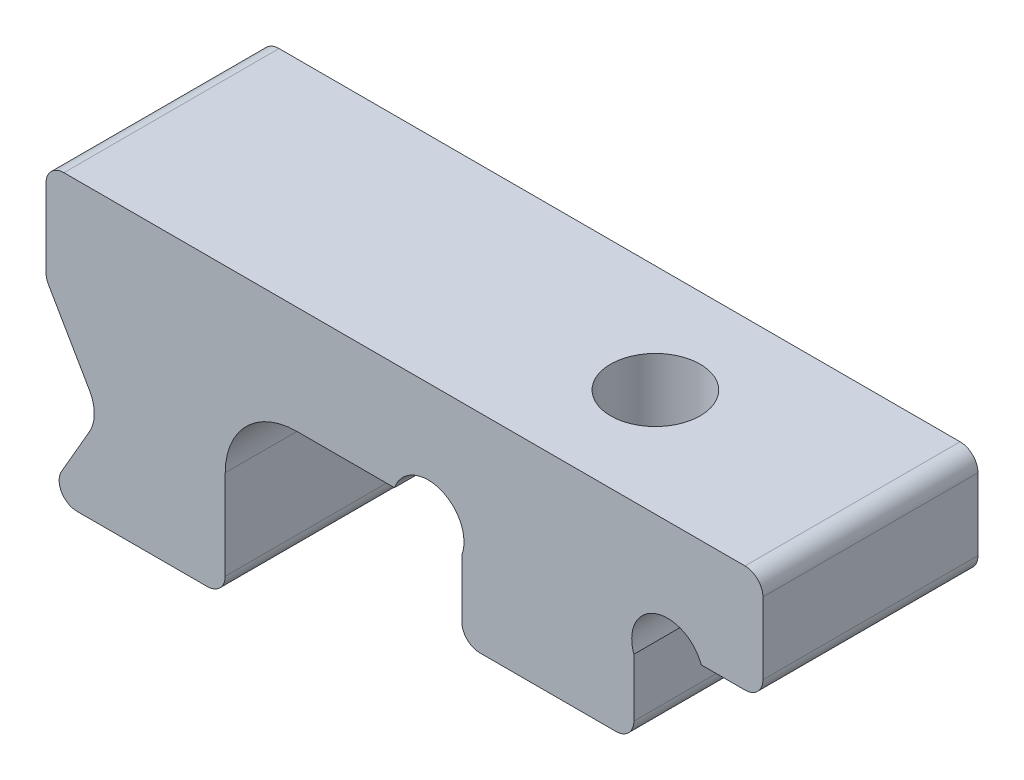
ISO-10303-21;
HEADER;
FILE_DESCRIPTION(('STEP AP214'),'2;1');
FILE_NAME('part.step','',(''),(''),'','','');
FILE_SCHEMA(('AUTOMOTIVE_DESIGN { 1 0 10303 214 1 1 1 1 }'));
ENDSEC;
DATA;
#1=APPLICATION_CONTEXT('core data for automotive mechanical design processes');
#2=APPLICATION_PROTOCOL_DEFINITION('international standard','automotive_design',2000,#1);
#3=PRODUCT_CONTEXT('',#1,'mechanical');
#4=PRODUCT('Part','Part','',(#3));
#5=PRODUCT_RELATED_PRODUCT_CATEGORY('part','',(#4));
#6=PRODUCT_DEFINITION_FORMATION('','',#4);
#7=PRODUCT_DEFINITION_CONTEXT('part definition',#1,'design');
#8=PRODUCT_DEFINITION('design','',#6,#7);
#9=PRODUCT_DEFINITION_SHAPE('','',#8);
#10=(LENGTH_UNIT() NAMED_UNIT(*) SI_UNIT(.MILLI.,.METRE.));
#11=(NAMED_UNIT(*) PLANE_ANGLE_UNIT() SI_UNIT($,.RADIAN.));
#12=(NAMED_UNIT(*) SI_UNIT($,.STERADIAN.) SOLID_ANGLE_UNIT());
#13=UNCERTAINTY_MEASURE_WITH_UNIT(LENGTH_MEASURE(1.E-05),#10,'distance_accuracy_value','');
#14=(GEOMETRIC_REPRESENTATION_CONTEXT(3) GLOBAL_UNCERTAINTY_ASSIGNED_CONTEXT((#13)) GLOBAL_UNIT_ASSIGNED_CONTEXT((#10,
#11,#12)) REPRESENTATION_CONTEXT('',''));
#15=CARTESIAN_POINT('',(0.,0.,0.));
#16=DIRECTION('',(0.,0.,1.));
#17=DIRECTION('',(1.,0.,0.));
#18=AXIS2_PLACEMENT_3D('',#15,#16,#17);
#19=CARTESIAN_POINT('',(-6.,0.,3.));
#20=DIRECTION('',(0.,1.,0.));
#21=DIRECTION('',(-1.,0.,0.));
#22=AXIS2_PLACEMENT_3D('',#19,#20,#21);
#23=PLANE('',#22);
#24=DIRECTION('',(1.,0.,0.));
#25=VECTOR('',#24,1.);
#26=CARTESIAN_POINT('',(-6.,0.,-3.));
#27=LINE('',#26,#25);
#28=CARTESIAN_POINT('',(-7.,0.,-3.));
#29=VERTEX_POINT('',#28);
#30=CARTESIAN_POINT('',(-4.27938524157181,0.,-3.));
#31=VERTEX_POINT('',#30);
#32=EDGE_CURVE('E255',#29,#31,#27,.T.);
#33=ORIENTED_EDGE('',*,*,#32,.T.);
#34=DIRECTION('',(0.,0.,-1.));
#35=VECTOR('',#34,1.);
#36=CARTESIAN_POINT('',(-4.27938524157181,0.,3.));
#37=LINE('',#36,#35);
#38=CARTESIAN_POINT('',(-4.27938524157181,0.,3.));
#39=VERTEX_POINT('',#38);
#40=EDGE_CURVE('E408',#39,#31,#37,.T.);
#41=ORIENTED_EDGE('',*,*,#40,.F.);
#42=DIRECTION('',(1.,0.,0.));
#43=VECTOR('',#42,1.);
#44=CARTESIAN_POINT('',(-6.,0.,3.));
#45=LINE('',#44,#43);
#46=CARTESIAN_POINT('',(-7.,0.,3.));
#47=VERTEX_POINT('',#46);
#48=EDGE_CURVE('E434',#47,#39,#45,.T.);
#49=ORIENTED_EDGE('',*,*,#48,.F.);
#50=DIRECTION('',(0.,0.,1.));
#51=VECTOR('',#50,1.);
#52=CARTESIAN_POINT('',(-7.,0.,-3.));
#53=LINE('',#52,#51);
#54=EDGE_CURVE('E379',#47,#29,#53,.F.);
#55=ORIENTED_EDGE('',*,*,#54,.T.);
#56=EDGE_LOOP('',(#33,#41,#49,#55));
#57=FACE_BOUND('',#56,.T.);
#58=ADVANCED_FACE('F47',(#57),#23,.F.);
#59=CARTESIAN_POINT('',(6.,0.,3.));
#60=DIRECTION('',(-1.,0.,0.));
#61=DIRECTION('',(0.,0.,1.));
#62=AXIS2_PLACEMENT_3D('',#59,#60,#61);
#63=PLANE('',#62);
#64=DIRECTION('',(0.,1.,0.));
#65=VECTOR('',#64,1.);
#66=CARTESIAN_POINT('',(6.,0.,-3.));
#67=LINE('',#66,#65);
#68=CARTESIAN_POINT('',(6.,0.499999999999999,-3.));
#69=VERTEX_POINT('',#68);
#70=CARTESIAN_POINT('',(6.,2.5,-3.));
#71=VERTEX_POINT('',#70);
#72=EDGE_CURVE('E246',#69,#71,#67,.T.);
#73=ORIENTED_EDGE('',*,*,#72,.T.);
#74=DIRECTION('',(0.,0.,-1.));
#75=VECTOR('',#74,1.);
#76=CARTESIAN_POINT('',(6.,2.5,3.));
#77=LINE('',#76,#75);
#78=CARTESIAN_POINT('',(6.,2.5,3.));
#79=VERTEX_POINT('',#78);
#80=EDGE_CURVE('E370',#71,#79,#77,.F.);
#81=ORIENTED_EDGE('',*,*,#80,.T.);
#82=DIRECTION('',(0.,1.,0.));
#83=VECTOR('',#82,1.);
#84=CARTESIAN_POINT('',(6.,0.,3.));
#85=LINE('',#84,#83);
#86=CARTESIAN_POINT('',(6.,0.499999999999999,3.));
#87=VERTEX_POINT('',#86);
#88=EDGE_CURVE('E272',#87,#79,#85,.T.);
#89=ORIENTED_EDGE('',*,*,#88,.F.);
#90=DIRECTION('',(0.,0.,-1.));
#91=VECTOR('',#90,1.);
#92=CARTESIAN_POINT('',(6.,0.499999999999999,3.));
#93=LINE('',#92,#91);
#94=EDGE_CURVE('E366',#87,#69,#93,.T.);
#95=ORIENTED_EDGE('',*,*,#94,.T.);
#96=EDGE_LOOP('',(#73,#81,#89,#95));
#97=FACE_BOUND('',#96,.T.);
#98=ADVANCED_FACE('F514',(#97),#63,.F.);
#99=CARTESIAN_POINT('',(-6.,3.,3.));
#100=DIRECTION('',(0.,-1.,0.));
#101=DIRECTION('',(0.,0.,-1.));
#102=AXIS2_PLACEMENT_3D('',#99,#100,#101);
#103=PLANE('',#102);
#104=CARTESIAN_POINT('',(0.,3.,0.));
#105=DIRECTION('',(0.,1.,0.));
#106=DIRECTION('',(0.,0.,1.));
#107=AXIS2_PLACEMENT_3D('',#104,#105,#106);
#108=CIRCLE('',#107,1.25);
#109=CARTESIAN_POINT('',(0.,3.,1.25));
#110=VERTEX_POINT('',#109);
#111=EDGE_CURVE('E447',#110,#110,#108,.T.);
#112=ORIENTED_EDGE('',*,*,#111,.F.);
#113=EDGE_LOOP('',(#112));
#114=FACE_BOUND('',#113,.T.);
#115=DIRECTION('',(-1.,0.,0.));
#116=VECTOR('',#115,1.);
#117=CARTESIAN_POINT('',(-6.,3.,-3.));
#118=LINE('',#117,#116);
#119=CARTESIAN_POINT('',(5.5,3.,-3.));
#120=VERTEX_POINT('',#119);
#121=CARTESIAN_POINT('',(-13.5,3.,-3.));
#122=VERTEX_POINT('',#121);
#123=EDGE_CURVE('E250',#120,#122,#118,.T.);
#124=ORIENTED_EDGE('',*,*,#123,.T.);
#125=DIRECTION('',(0.,0.,-1.));
#126=VECTOR('',#125,1.);
#127=CARTESIAN_POINT('',(-13.5,3.,3.));
#128=LINE('',#127,#126);
#129=CARTESIAN_POINT('',(-13.5,3.,3.));
#130=VERTEX_POINT('',#129);
#131=EDGE_CURVE('E335',#122,#130,#128,.F.);
#132=ORIENTED_EDGE('',*,*,#131,.T.);
#133=DIRECTION('',(-1.,0.,0.));
#134=VECTOR('',#133,1.);
#135=CARTESIAN_POINT('',(-6.,3.,3.));
#136=LINE('',#135,#134);
#137=CARTESIAN_POINT('',(5.5,3.,3.));
#138=VERTEX_POINT('',#137);
#139=EDGE_CURVE('E440',#138,#130,#136,.T.);
#140=ORIENTED_EDGE('',*,*,#139,.F.);
#141=DIRECTION('',(0.,0.,-1.));
#142=VECTOR('',#141,1.);
#143=CARTESIAN_POINT('',(5.5,3.,3.));
#144=LINE('',#143,#142);
#145=EDGE_CURVE('E331',#138,#120,#144,.T.);
#146=ORIENTED_EDGE('',*,*,#145,.T.);
#147=EDGE_LOOP('',(#124,#132,#140,#146));
#148=FACE_BOUND('',#147,.T.);
#149=ADVANCED_FACE('F520',(#114,#148),#103,.F.);
#150=CARTESIAN_POINT('',(-2.4,0.,3.));
#151=DIRECTION('',(1.,0.,0.));
#152=DIRECTION('',(0.,1.,0.));
#153=AXIS2_PLACEMENT_3D('',#150,#151,#152);
#154=PLANE('',#153);
#155=DIRECTION('',(0.,-1.,0.));
#156=VECTOR('',#155,1.);
#157=CARTESIAN_POINT('',(-2.4,0.,3.));
#158=LINE('',#157,#156);
#159=CARTESIAN_POINT('',(-2.4,-0.684040286651345,3.));
#160=VERTEX_POINT('',#159);
#161=CARTESIAN_POINT('',(-2.4,-2.3,3.));
#162=VERTEX_POINT('',#161);
#163=EDGE_CURVE('E414',#160,#162,#158,.T.);
#164=ORIENTED_EDGE('',*,*,#163,.F.);
#165=DIRECTION('',(0.,0.,-1.));
#166=VECTOR('',#165,1.);
#167=CARTESIAN_POINT('',(-2.4,-0.684040286651345,3.));
#168=LINE('',#167,#166);
#169=CARTESIAN_POINT('',(-2.4,-0.684040286651345,-3.));
#170=VERTEX_POINT('',#169);
#171=EDGE_CURVE('E405',#160,#170,#168,.T.);
#172=ORIENTED_EDGE('',*,*,#171,.T.);
#173=DIRECTION('',(0.,-1.,0.));
#174=VECTOR('',#173,1.);
#175=CARTESIAN_POINT('',(-2.4,0.,-3.));
#176=LINE('',#175,#174);
#177=CARTESIAN_POINT('',(-2.4,-2.3,-3.));
#178=VERTEX_POINT('',#177);
#179=EDGE_CURVE('E259',#170,#178,#176,.T.);
#180=ORIENTED_EDGE('',*,*,#179,.T.);
#181=DIRECTION('',(0.,0.,-1.));
#182=VECTOR('',#181,1.);
#183=CARTESIAN_POINT('',(-2.4,-2.3,3.));
#184=LINE('',#183,#182);
#185=EDGE_CURVE('E358',#178,#162,#184,.F.);
#186=ORIENTED_EDGE('',*,*,#185,.T.);
#187=EDGE_LOOP('',(#164,#172,#180,#186));
#188=FACE_BOUND('',#187,.T.);
#189=ADVANCED_FACE('F413',(#188),#154,.F.);
#190=CARTESIAN_POINT('',(-2.4,-2.8,3.));
#191=DIRECTION('',(0.,1.,0.));
#192=DIRECTION('',(0.,0.,1.));
#193=AXIS2_PLACEMENT_3D('',#190,#191,#192);
#194=PLANE('',#193);
#195=CARTESIAN_POINT('',(0.,-2.8,0.));
#196=DIRECTION('',(0.,1.,0.));
#197=DIRECTION('',(0.,0.,1.));
#198=AXIS2_PLACEMENT_3D('',#195,#196,#197);
#199=CIRCLE('',#198,1.25);
#200=CARTESIAN_POINT('',(0.,-2.8,1.25));
#201=VERTEX_POINT('',#200);
#202=EDGE_CURVE('E251',#201,#201,#199,.T.);
#203=ORIENTED_EDGE('',*,*,#202,.T.);
#204=EDGE_LOOP('',(#203));
#205=FACE_BOUND('',#204,.T.);
#206=DIRECTION('',(1.,0.,0.));
#207=VECTOR('',#206,1.);
#208=CARTESIAN_POINT('',(-2.4,-2.8,3.));
#209=LINE('',#208,#207);
#210=CARTESIAN_POINT('',(-1.9,-2.8,3.));
#211=VERTEX_POINT('',#210);
#212=CARTESIAN_POINT('',(1.9,-2.8,3.));
#213=VERTEX_POINT('',#212);
#214=EDGE_CURVE('E242',#211,#213,#209,.T.);
#215=ORIENTED_EDGE('',*,*,#214,.F.);
#216=DIRECTION('',(0.,0.,-1.));
#217=VECTOR('',#216,1.);
#218=CARTESIAN_POINT('',(-1.9,-2.8,3.));
#219=LINE('',#218,#217);
#220=CARTESIAN_POINT('',(-1.9,-2.8,-3.));
#221=VERTEX_POINT('',#220);
#222=EDGE_CURVE('E354',#211,#221,#219,.T.);
#223=ORIENTED_EDGE('',*,*,#222,.T.);
#224=DIRECTION('',(1.,0.,0.));
#225=VECTOR('',#224,1.);
#226=CARTESIAN_POINT('',(-2.4,-2.8,-3.));
#227=LINE('',#226,#225);
#228=CARTESIAN_POINT('',(1.9,-2.8,-3.));
#229=VERTEX_POINT('',#228);
#230=EDGE_CURVE('E262',#221,#229,#227,.T.);
#231=ORIENTED_EDGE('',*,*,#230,.T.);
#232=DIRECTION('',(0.,0.,-1.));
#233=VECTOR('',#232,1.);
#234=CARTESIAN_POINT('',(1.9,-2.8,3.));
#235=LINE('',#234,#233);
#236=EDGE_CURVE('E352',#229,#213,#235,.F.);
#237=ORIENTED_EDGE('',*,*,#236,.T.);
#238=EDGE_LOOP('',(#215,#223,#231,#237));
#239=FACE_BOUND('',#238,.T.);
#240=ADVANCED_FACE('F428',(#205,#239),#194,.F.);
#241=CARTESIAN_POINT('',(2.4,0.,3.));
#242=DIRECTION('',(-1.,0.,0.));
#243=DIRECTION('',(0.,-1.,0.));
#244=AXIS2_PLACEMENT_3D('',#241,#242,#243);
#245=PLANE('',#244);
#246=DIRECTION('',(0.,1.,0.));
#247=VECTOR('',#246,1.);
#248=CARTESIAN_POINT('',(2.4,0.,-3.));
#249=LINE('',#248,#247);
#250=CARTESIAN_POINT('',(2.4,-2.3,-3.));
#251=VERTEX_POINT('',#250);
#252=CARTESIAN_POINT('',(2.4,-0.684040286651345,-3.));
#253=VERTEX_POINT('',#252);
#254=EDGE_CURVE('E266',#251,#253,#249,.T.);
#255=ORIENTED_EDGE('',*,*,#254,.T.);
#256=DIRECTION('',(0.,0.,-1.));
#257=VECTOR('',#256,1.);
#258=CARTESIAN_POINT('',(2.4,-0.684040286651345,3.));
#259=LINE('',#258,#257);
#260=CARTESIAN_POINT('',(2.4,-0.684040286651345,3.));
#261=VERTEX_POINT('',#260);
#262=EDGE_CURVE('E216',#261,#253,#259,.T.);
#263=ORIENTED_EDGE('',*,*,#262,.F.);
#264=DIRECTION('',(0.,1.,0.));
#265=VECTOR('',#264,1.);
#266=CARTESIAN_POINT('',(2.4,0.,3.));
#267=LINE('',#266,#265);
#268=CARTESIAN_POINT('',(2.4,-2.3,3.));
#269=VERTEX_POINT('',#268);
#270=EDGE_CURVE('E223',#269,#261,#267,.T.);
#271=ORIENTED_EDGE('',*,*,#270,.F.);
#272=DIRECTION('',(0.,0.,-1.));
#273=VECTOR('',#272,1.);
#274=CARTESIAN_POINT('',(2.4,-2.3,3.));
#275=LINE('',#274,#273);
#276=EDGE_CURVE('E362',#269,#251,#275,.T.);
#277=ORIENTED_EDGE('',*,*,#276,.T.);
#278=EDGE_LOOP('',(#255,#263,#271,#277));
#279=FACE_BOUND('',#278,.T.);
#280=ADVANCED_FACE('F497',(#279),#245,.F.);
#281=CARTESIAN_POINT('',(6.,0.,3.));
#282=DIRECTION('',(0.,1.,0.));
#283=DIRECTION('',(-1.,0.,0.));
#284=AXIS2_PLACEMENT_3D('',#281,#282,#283);
#285=PLANE('',#284);
#286=DIRECTION('',(1.,0.,0.));
#287=VECTOR('',#286,1.);
#288=CARTESIAN_POINT('',(6.,0.,3.));
#289=LINE('',#288,#287);
#290=CARTESIAN_POINT('',(4.27938524157181,0.,3.));
#291=VERTEX_POINT('',#290);
#292=CARTESIAN_POINT('',(5.5,0.,3.));
#293=VERTEX_POINT('',#292);
#294=EDGE_CURVE('E220',#291,#293,#289,.T.);
#295=ORIENTED_EDGE('',*,*,#294,.F.);
#296=DIRECTION('',(0.,0.,-1.));
#297=VECTOR('',#296,1.);
#298=CARTESIAN_POINT('',(4.27938524157181,0.,3.));
#299=LINE('',#298,#297);
#300=CARTESIAN_POINT('',(4.27938524157181,0.,-3.));
#301=VERTEX_POINT('',#300);
#302=EDGE_CURVE('E208',#291,#301,#299,.T.);
#303=ORIENTED_EDGE('',*,*,#302,.T.);
#304=DIRECTION('',(1.,0.,0.));
#305=VECTOR('',#304,1.);
#306=CARTESIAN_POINT('',(6.,0.,-3.));
#307=LINE('',#306,#305);
#308=CARTESIAN_POINT('',(5.5,0.,-3.));
#309=VERTEX_POINT('',#308);
#310=EDGE_CURVE('E270',#301,#309,#307,.T.);
#311=ORIENTED_EDGE('',*,*,#310,.T.);
#312=DIRECTION('',(0.,0.,-1.));
#313=VECTOR('',#312,1.);
#314=CARTESIAN_POINT('',(5.5,0.,3.));
#315=LINE('',#314,#313);
#316=EDGE_CURVE('E229',#309,#293,#315,.F.);
#317=ORIENTED_EDGE('',*,*,#316,.T.);
#318=EDGE_LOOP('',(#295,#303,#311,#317));
#319=FACE_BOUND('',#318,.T.);
#320=ADVANCED_FACE('F227',(#319),#285,.F.);
#321=CARTESIAN_POINT('',(0.,0.,3.));
#322=DIRECTION('',(0.,0.,-1.));
#323=DIRECTION('',(-1.,0.,0.));
#324=AXIS2_PLACEMENT_3D('',#321,#322,#323);
#325=PLANE('',#324);
#326=ORIENTED_EDGE('',*,*,#270,.T.);
#327=CARTESIAN_POINT('',(3.33969262078591,-0.342020143325673,3.));
#328=DIRECTION('',(0.,0.,-1.));
#329=DIRECTION('',(1.,0.,0.));
#330=AXIS2_PLACEMENT_3D('',#327,#328,#329);
#331=CIRCLE('',#330,1.);
#332=EDGE_CURVE('E211',#261,#291,#331,.T.);
#333=ORIENTED_EDGE('',*,*,#332,.T.);
#334=ORIENTED_EDGE('',*,*,#294,.T.);
#335=CARTESIAN_POINT('',(5.5,0.499999999999999,3.));
#336=DIRECTION('',(0.,0.,-1.));
#337=DIRECTION('',(-1.,0.,0.));
#338=AXIS2_PLACEMENT_3D('',#335,#336,#337);
#339=CIRCLE('',#338,0.5);
#340=EDGE_CURVE('E277',#293,#87,#339,.F.);
#341=ORIENTED_EDGE('',*,*,#340,.T.);
#342=ORIENTED_EDGE('',*,*,#88,.T.);
#343=CARTESIAN_POINT('',(5.5,2.5,3.));
#344=DIRECTION('',(0.,0.,-1.));
#345=DIRECTION('',(-1.,0.,0.));
#346=AXIS2_PLACEMENT_3D('',#343,#344,#345);
#347=CIRCLE('',#346,0.5);
#348=EDGE_CURVE('E280',#79,#138,#347,.F.);
#349=ORIENTED_EDGE('',*,*,#348,.T.);
#350=ORIENTED_EDGE('',*,*,#139,.T.);
#351=CARTESIAN_POINT('',(-13.5,2.5,3.));
#352=DIRECTION('',(0.,0.,-1.));
#353=DIRECTION('',(-1.,0.,0.));
#354=AXIS2_PLACEMENT_3D('',#351,#352,#353);
#355=CIRCLE('',#354,0.5);
#356=CARTESIAN_POINT('',(-14.,2.5,3.));
#357=VERTEX_POINT('',#356);
#358=EDGE_CURVE('E294',#130,#357,#355,.F.);
#359=ORIENTED_EDGE('',*,*,#358,.T.);
#360=DIRECTION('',(0.,1.,0.));
#361=VECTOR('',#360,1.);
#362=CARTESIAN_POINT('',(-14.,3.,3.));
#363=LINE('',#362,#361);
#364=CARTESIAN_POINT('',(-14.,0.333974596215562,3.));
#365=VERTEX_POINT('',#364);
#366=EDGE_CURVE('E451',#365,#357,#363,.T.);
#367=ORIENTED_EDGE('',*,*,#366,.F.);
#368=CARTESIAN_POINT('',(-13.5,0.333974596215562,3.));
#369=DIRECTION('',(0.,0.,-1.));
#370=DIRECTION('',(-1.,0.,0.));
#371=AXIS2_PLACEMENT_3D('',#368,#369,#370);
#372=CIRCLE('',#371,0.5);
#373=CARTESIAN_POINT('',(-13.9330127018922,0.0839745962155611,3.));
#374=VERTEX_POINT('',#373);
#375=EDGE_CURVE('E297',#365,#374,#372,.F.);
#376=ORIENTED_EDGE('',*,*,#375,.T.);
#377=DIRECTION('',(-0.500000000000001,0.866025403784438,0.));
#378=VECTOR('',#377,1.);
#379=CARTESIAN_POINT('',(-14.,0.2,3.));
#380=LINE('',#379,#378);
#381=CARTESIAN_POINT('',(-12.7875644347018,-1.9,3.));
#382=VERTEX_POINT('',#381);
#383=EDGE_CURVE('E478',#382,#374,#380,.T.);
#384=ORIENTED_EDGE('',*,*,#383,.F.);
#385=CARTESIAN_POINT('',(-13.6535898384862,-2.4,3.));
#386=DIRECTION('',(0.,0.,-1.));
#387=DIRECTION('',(-1.,0.,0.));
#388=AXIS2_PLACEMENT_3D('',#385,#386,#387);
#389=CIRCLE('',#388,1.);
#390=CARTESIAN_POINT('',(-12.7875644347018,-2.9,3.));
#391=VERTEX_POINT('',#390);
#392=EDGE_CURVE('E69',#382,#391,#389,.T.);
#393=ORIENTED_EDGE('',*,*,#392,.T.);
#394=DIRECTION('',(0.500000000000001,0.866025403784438,0.));
#395=VECTOR('',#394,1.);
#396=CARTESIAN_POINT('',(-12.498889300107,-2.4,3.));
#397=LINE('',#396,#395);
#398=CARTESIAN_POINT('',(-13.5669872981078,-4.25,3.));
#399=VERTEX_POINT('',#398);
#400=EDGE_CURVE('E482',#399,#391,#397,.T.);
#401=ORIENTED_EDGE('',*,*,#400,.F.);
#402=CARTESIAN_POINT('',(-13.1339745962156,-4.5,3.));
#403=DIRECTION('',(0.,0.,-1.));
#404=DIRECTION('',(-1.,0.,0.));
#405=AXIS2_PLACEMENT_3D('',#402,#403,#404);
#406=CIRCLE('',#405,0.5);
#407=CARTESIAN_POINT('',(-13.1339745962156,-5.,3.));
#408=VERTEX_POINT('',#407);
#409=EDGE_CURVE('E292',#399,#408,#406,.F.);
#410=ORIENTED_EDGE('',*,*,#409,.T.);
#411=DIRECTION('',(-1.,0.,0.));
#412=VECTOR('',#411,1.);
#413=CARTESIAN_POINT('',(-14.,-5.,3.));
#414=LINE('',#413,#412);
#415=CARTESIAN_POINT('',(-9.5,-5.,3.));
#416=VERTEX_POINT('',#415);
#417=EDGE_CURVE('E470',#416,#408,#414,.T.);
#418=ORIENTED_EDGE('',*,*,#417,.F.);
#419=CARTESIAN_POINT('',(-9.5,-4.5,3.));
#420=DIRECTION('',(0.,0.,-1.));
#421=DIRECTION('',(-1.,0.,0.));
#422=AXIS2_PLACEMENT_3D('',#419,#420,#421);
#423=CIRCLE('',#422,0.5);
#424=CARTESIAN_POINT('',(-9.,-4.5,3.));
#425=VERTEX_POINT('',#424);
#426=EDGE_CURVE('E289',#416,#425,#423,.F.);
#427=ORIENTED_EDGE('',*,*,#426,.T.);
#428=DIRECTION('',(0.,1.,0.));
#429=VECTOR('',#428,1.);
#430=CARTESIAN_POINT('',(-9.,-5.,3.));
#431=LINE('',#430,#429);
#432=CARTESIAN_POINT('',(-9.,-2.,3.));
#433=VERTEX_POINT('',#432);
#434=EDGE_CURVE('E466',#425,#433,#431,.T.);
#435=ORIENTED_EDGE('',*,*,#434,.T.);
#436=CARTESIAN_POINT('',(-7.,-2.,3.));
#437=DIRECTION('',(0.,0.,-1.));
#438=DIRECTION('',(-1.,0.,0.));
#439=AXIS2_PLACEMENT_3D('',#436,#437,#438);
#440=CIRCLE('',#439,2.);
#441=EDGE_CURVE('E382',#433,#47,#440,.T.);
#442=ORIENTED_EDGE('',*,*,#441,.T.);
#443=ORIENTED_EDGE('',*,*,#48,.T.);
#444=CARTESIAN_POINT('',(-3.33969262078591,-0.342020143325673,3.));
#445=DIRECTION('',(0.,0.,-1.));
#446=DIRECTION('',(-1.,0.,0.));
#447=AXIS2_PLACEMENT_3D('',#444,#445,#446);
#448=CIRCLE('',#447,1.);
#449=EDGE_CURVE('E225',#39,#160,#448,.T.);
#450=ORIENTED_EDGE('',*,*,#449,.T.);
#451=ORIENTED_EDGE('',*,*,#163,.T.);
#452=CARTESIAN_POINT('',(-1.9,-2.3,3.));
#453=DIRECTION('',(0.,0.,-1.));
#454=DIRECTION('',(-1.,0.,0.));
#455=AXIS2_PLACEMENT_3D('',#452,#453,#454);
#456=CIRCLE('',#455,0.5);
#457=EDGE_CURVE('E286',#162,#211,#456,.F.);
#458=ORIENTED_EDGE('',*,*,#457,.T.);
#459=ORIENTED_EDGE('',*,*,#214,.T.);
#460=CARTESIAN_POINT('',(1.9,-2.3,3.));
#461=DIRECTION('',(0.,0.,-1.));
#462=DIRECTION('',(-1.,0.,0.));
#463=AXIS2_PLACEMENT_3D('',#460,#461,#462);
#464=CIRCLE('',#463,0.5);
#465=EDGE_CURVE('E283',#213,#269,#464,.F.);
#466=ORIENTED_EDGE('',*,*,#465,.T.);
#467=EDGE_LOOP('',(#326,#333,#334,#341,#342,#349,#350,#359,#367,#376,#384,#393,#401,#410,#418,
#427,#435,#442,#443,#450,#451,#458,#459,#466));
#468=FACE_BOUND('',#467,.T.);
#469=ADVANCED_FACE('F219',(#468),#325,.F.);
#470=CARTESIAN_POINT('',(0.,0.,-3.));
#471=DIRECTION('',(0.,0.,-1.));
#472=DIRECTION('',(-1.,0.,0.));
#473=AXIS2_PLACEMENT_3D('',#470,#471,#472);
#474=PLANE('',#473);
#475=CARTESIAN_POINT('',(3.33969262078591,-0.342020143325673,-3.));
#476=DIRECTION('',(0.,0.,-1.));
#477=DIRECTION('',(-1.,0.,0.));
#478=AXIS2_PLACEMENT_3D('',#475,#476,#477);
#479=CIRCLE('',#478,1.);
#480=EDGE_CURVE('E11',#253,#301,#479,.T.);
#481=ORIENTED_EDGE('',*,*,#480,.F.);
#482=ORIENTED_EDGE('',*,*,#254,.F.);
#483=CARTESIAN_POINT('',(1.9,-2.3,-3.));
#484=DIRECTION('',(0.,0.,-1.));
#485=DIRECTION('',(-1.,0.,0.));
#486=AXIS2_PLACEMENT_3D('',#483,#484,#485);
#487=CIRCLE('',#486,0.5);
#488=EDGE_CURVE('E312',#251,#229,#487,.T.);
#489=ORIENTED_EDGE('',*,*,#488,.T.);
#490=ORIENTED_EDGE('',*,*,#230,.F.);
#491=CARTESIAN_POINT('',(-1.9,-2.3,-3.));
#492=DIRECTION('',(0.,0.,-1.));
#493=DIRECTION('',(-1.,0.,0.));
#494=AXIS2_PLACEMENT_3D('',#491,#492,#493);
#495=CIRCLE('',#494,0.5);
#496=EDGE_CURVE('E315',#221,#178,#495,.T.);
#497=ORIENTED_EDGE('',*,*,#496,.T.);
#498=ORIENTED_EDGE('',*,*,#179,.F.);
#499=CARTESIAN_POINT('',(-3.33969262078591,-0.342020143325673,-3.));
#500=DIRECTION('',(0.,0.,-1.));
#501=DIRECTION('',(-1.,0.,0.));
#502=AXIS2_PLACEMENT_3D('',#499,#500,#501);
#503=CIRCLE('',#502,1.);
#504=EDGE_CURVE('E56',#31,#170,#503,.T.);
#505=ORIENTED_EDGE('',*,*,#504,.F.);
#506=ORIENTED_EDGE('',*,*,#32,.F.);
#507=CARTESIAN_POINT('',(-7.,-2.,-3.));
#508=DIRECTION('',(0.,0.,-1.));
#509=DIRECTION('',(-1.,0.,0.));
#510=AXIS2_PLACEMENT_3D('',#507,#508,#509);
#511=CIRCLE('',#510,2.);
#512=CARTESIAN_POINT('',(-9.,-2.,-3.));
#513=VERTEX_POINT('',#512);
#514=EDGE_CURVE('E385',#29,#513,#511,.F.);
#515=ORIENTED_EDGE('',*,*,#514,.T.);
#516=DIRECTION('',(0.,1.,0.));
#517=VECTOR('',#516,1.);
#518=CARTESIAN_POINT('',(-9.,-5.,-3.));
#519=LINE('',#518,#517);
#520=CARTESIAN_POINT('',(-9.,-4.5,-3.));
#521=VERTEX_POINT('',#520);
#522=EDGE_CURVE('E462',#521,#513,#519,.T.);
#523=ORIENTED_EDGE('',*,*,#522,.F.);
#524=CARTESIAN_POINT('',(-9.5,-4.5,-3.));
#525=DIRECTION('',(0.,0.,-1.));
#526=DIRECTION('',(-1.,0.,0.));
#527=AXIS2_PLACEMENT_3D('',#524,#525,#526);
#528=CIRCLE('',#527,0.5);
#529=CARTESIAN_POINT('',(-9.5,-5.,-3.));
#530=VERTEX_POINT('',#529);
#531=EDGE_CURVE('E319',#521,#530,#528,.T.);
#532=ORIENTED_EDGE('',*,*,#531,.T.);
#533=DIRECTION('',(1.,0.,0.));
#534=VECTOR('',#533,1.);
#535=CARTESIAN_POINT('',(-14.,-5.,-3.));
#536=LINE('',#535,#534);
#537=CARTESIAN_POINT('',(-13.1339745962156,-5.,-3.));
#538=VERTEX_POINT('',#537);
#539=EDGE_CURVE('E474',#538,#530,#536,.T.);
#540=ORIENTED_EDGE('',*,*,#539,.F.);
#541=CARTESIAN_POINT('',(-13.1339745962156,-4.5,-3.));
#542=DIRECTION('',(0.,0.,-1.));
#543=DIRECTION('',(-1.,0.,0.));
#544=AXIS2_PLACEMENT_3D('',#541,#542,#543);
#545=CIRCLE('',#544,0.5);
#546=CARTESIAN_POINT('',(-13.5669872981078,-4.25,-3.));
#547=VERTEX_POINT('',#546);
#548=EDGE_CURVE('E322',#538,#547,#545,.T.);
#549=ORIENTED_EDGE('',*,*,#548,.T.);
#550=DIRECTION('',(0.500000000000001,0.866025403784438,0.));
#551=VECTOR('',#550,1.);
#552=CARTESIAN_POINT('',(-12.498889300107,-2.4,-3.));
#553=LINE('',#552,#551);
#554=CARTESIAN_POINT('',(-12.7875644347018,-2.9,-3.));
#555=VERTEX_POINT('',#554);
#556=EDGE_CURVE('E481',#547,#555,#553,.T.);
#557=ORIENTED_EDGE('',*,*,#556,.T.);
#558=CARTESIAN_POINT('',(-13.6535898384862,-2.4,-3.));
#559=DIRECTION('',(0.,0.,-1.));
#560=DIRECTION('',(-1.,0.,0.));
#561=AXIS2_PLACEMENT_3D('',#558,#559,#560);
#562=CIRCLE('',#561,1.);
#563=CARTESIAN_POINT('',(-12.7875644347018,-1.9,-3.));
#564=VERTEX_POINT('',#563);
#565=EDGE_CURVE('E397',#555,#564,#562,.F.);
#566=ORIENTED_EDGE('',*,*,#565,.T.);
#567=DIRECTION('',(-0.500000000000001,0.866025403784438,0.));
#568=VECTOR('',#567,1.);
#569=CARTESIAN_POINT('',(-14.,0.2,-3.));
#570=LINE('',#569,#568);
#571=CARTESIAN_POINT('',(-13.9330127018922,0.0839745962155611,-3.));
#572=VERTEX_POINT('',#571);
#573=EDGE_CURVE('E477',#564,#572,#570,.T.);
#574=ORIENTED_EDGE('',*,*,#573,.T.);
#575=CARTESIAN_POINT('',(-13.5,0.333974596215562,-3.));
#576=DIRECTION('',(0.,0.,-1.));
#577=DIRECTION('',(-1.,0.,0.));
#578=AXIS2_PLACEMENT_3D('',#575,#576,#577);
#579=CIRCLE('',#578,0.5);
#580=CARTESIAN_POINT('',(-14.,0.333974596215562,-3.));
#581=VERTEX_POINT('',#580);
#582=EDGE_CURVE('E328',#572,#581,#579,.T.);
#583=ORIENTED_EDGE('',*,*,#582,.T.);
#584=DIRECTION('',(0.,-1.,0.));
#585=VECTOR('',#584,1.);
#586=CARTESIAN_POINT('',(-14.,3.,-3.));
#587=LINE('',#586,#585);
#588=CARTESIAN_POINT('',(-14.,2.5,-3.));
#589=VERTEX_POINT('',#588);
#590=EDGE_CURVE('E458',#589,#581,#587,.T.);
#591=ORIENTED_EDGE('',*,*,#590,.F.);
#592=CARTESIAN_POINT('',(-13.5,2.5,-3.));
#593=DIRECTION('',(0.,0.,-1.));
#594=DIRECTION('',(-1.,0.,0.));
#595=AXIS2_PLACEMENT_3D('',#592,#593,#594);
#596=CIRCLE('',#595,0.5);
#597=EDGE_CURVE('E325',#589,#122,#596,.T.);
#598=ORIENTED_EDGE('',*,*,#597,.T.);
#599=ORIENTED_EDGE('',*,*,#123,.F.);
#600=CARTESIAN_POINT('',(5.5,2.5,-3.));
#601=DIRECTION('',(0.,0.,-1.));
#602=DIRECTION('',(-1.,0.,0.));
#603=AXIS2_PLACEMENT_3D('',#600,#601,#602);
#604=CIRCLE('',#603,0.5);
#605=EDGE_CURVE('E309',#120,#71,#604,.T.);
#606=ORIENTED_EDGE('',*,*,#605,.T.);
#607=ORIENTED_EDGE('',*,*,#72,.F.);
#608=CARTESIAN_POINT('',(5.5,0.499999999999999,-3.));
#609=DIRECTION('',(0.,0.,-1.));
#610=DIRECTION('',(-1.,0.,0.));
#611=AXIS2_PLACEMENT_3D('',#608,#609,#610);
#612=CIRCLE('',#611,0.5);
#613=EDGE_CURVE('E305',#69,#309,#612,.T.);
#614=ORIENTED_EDGE('',*,*,#613,.T.);
#615=ORIENTED_EDGE('',*,*,#310,.F.);
#616=EDGE_LOOP('',(#481,#482,#489,#490,#497,#498,#505,#506,#515,#523,#532,#540,#549,#557,#566,
#574,#583,#591,#598,#599,#606,#607,#614,#615));
#617=FACE_BOUND('',#616,.T.);
#618=ADVANCED_FACE('F417',(#617),#474,.T.);
#619=CARTESIAN_POINT('',(0.,-2.8,0.));
#620=DIRECTION('',(0.,1.,0.));
#621=DIRECTION('',(0.,0.,1.));
#622=AXIS2_PLACEMENT_3D('',#619,#620,#621);
#623=CYLINDRICAL_SURFACE('',#622,1.25);
#624=ORIENTED_EDGE('',*,*,#202,.F.);
#625=EDGE_LOOP('',(#624));
#626=FACE_BOUND('',#625,.T.);
#627=ORIENTED_EDGE('',*,*,#111,.T.);
#628=EDGE_LOOP('',(#627));
#629=FACE_BOUND('',#628,.T.);
#630=ADVANCED_FACE('F610',(#626,#629),#623,.F.);
#631=CARTESIAN_POINT('',(-14.,0.,0.));
#632=DIRECTION('',(-1.,0.,0.));
#633=DIRECTION('',(0.,0.,1.));
#634=AXIS2_PLACEMENT_3D('',#631,#632,#633);
#635=PLANE('',#634);
#636=ORIENTED_EDGE('',*,*,#590,.T.);
#637=DIRECTION('',(0.,0.,1.));
#638=VECTOR('',#637,1.);
#639=CARTESIAN_POINT('',(-14.,0.333974596215562,3.));
#640=LINE('',#639,#638);
#641=EDGE_CURVE('E239',#581,#365,#640,.T.);
#642=ORIENTED_EDGE('',*,*,#641,.T.);
#643=ORIENTED_EDGE('',*,*,#366,.T.);
#644=DIRECTION('',(0.,0.,-1.));
#645=VECTOR('',#644,1.);
#646=CARTESIAN_POINT('',(-14.,2.5,-3.));
#647=LINE('',#646,#645);
#648=EDGE_CURVE('E232',#357,#589,#647,.T.);
#649=ORIENTED_EDGE('',*,*,#648,.T.);
#650=EDGE_LOOP('',(#636,#642,#643,#649));
#651=FACE_BOUND('',#650,.T.);
#652=ADVANCED_FACE('F571',(#651),#635,.T.);
#653=CARTESIAN_POINT('',(-9.,-5.,3.));
#654=DIRECTION('',(-1.,0.,0.));
#655=DIRECTION('',(0.,-1.,0.));
#656=AXIS2_PLACEMENT_3D('',#653,#654,#655);
#657=PLANE('',#656);
#658=ORIENTED_EDGE('',*,*,#522,.T.);
#659=DIRECTION('',(0.,0.,1.));
#660=VECTOR('',#659,1.);
#661=CARTESIAN_POINT('',(-9.,-2.,3.));
#662=LINE('',#661,#660);
#663=EDGE_CURVE('E375',#513,#433,#662,.T.);
#664=ORIENTED_EDGE('',*,*,#663,.T.);
#665=ORIENTED_EDGE('',*,*,#434,.F.);
#666=DIRECTION('',(0.,0.,1.));
#667=VECTOR('',#666,1.);
#668=CARTESIAN_POINT('',(-9.,-4.5,-3.));
#669=LINE('',#668,#667);
#670=EDGE_CURVE('E349',#425,#521,#669,.F.);
#671=ORIENTED_EDGE('',*,*,#670,.T.);
#672=EDGE_LOOP('',(#658,#664,#665,#671));
#673=FACE_BOUND('',#672,.T.);
#674=ADVANCED_FACE('F600',(#673),#657,.F.);
#675=CARTESIAN_POINT('',(0.,-5.,0.));
#676=DIRECTION('',(0.,-1.,0.));
#677=DIRECTION('',(1.,0.,0.));
#678=AXIS2_PLACEMENT_3D('',#675,#676,#677);
#679=PLANE('',#678);
#680=ORIENTED_EDGE('',*,*,#417,.T.);
#681=DIRECTION('',(0.,0.,-1.));
#682=VECTOR('',#681,1.);
#683=CARTESIAN_POINT('',(-13.1339745962156,-5.,-3.));
#684=LINE('',#683,#682);
#685=EDGE_CURVE('E342',#408,#538,#684,.T.);
#686=ORIENTED_EDGE('',*,*,#685,.T.);
#687=ORIENTED_EDGE('',*,*,#539,.T.);
#688=DIRECTION('',(0.,0.,1.));
#689=VECTOR('',#688,1.);
#690=CARTESIAN_POINT('',(-9.5,-5.,3.));
#691=LINE('',#690,#689);
#692=EDGE_CURVE('E338',#530,#416,#691,.T.);
#693=ORIENTED_EDGE('',*,*,#692,.T.);
#694=EDGE_LOOP('',(#680,#686,#687,#693));
#695=FACE_BOUND('',#694,.T.);
#696=ADVANCED_FACE('F552',(#695),#679,.T.);
#697=CARTESIAN_POINT('',(-14.,0.2,-3.));
#698=DIRECTION('',(0.866025403784438,0.500000000000001,0.));
#699=DIRECTION('',(-0.500000000000001,0.866025403784438,0.));
#700=AXIS2_PLACEMENT_3D('',#697,#698,#699);
#701=PLANE('',#700);
#702=ORIENTED_EDGE('',*,*,#573,.F.);
#703=DIRECTION('',(0.,0.,1.));
#704=VECTOR('',#703,1.);
#705=CARTESIAN_POINT('',(-12.7875644347018,-1.9,3.));
#706=LINE('',#705,#704);
#707=EDGE_CURVE('E388',#564,#382,#706,.T.);
#708=ORIENTED_EDGE('',*,*,#707,.T.);
#709=ORIENTED_EDGE('',*,*,#383,.T.);
#710=DIRECTION('',(0.,0.,1.));
#711=VECTOR('',#710,1.);
#712=CARTESIAN_POINT('',(-13.9330127018922,0.083974596215561,-3.));
#713=LINE('',#712,#711);
#714=EDGE_CURVE('E301',#374,#572,#713,.F.);
#715=ORIENTED_EDGE('',*,*,#714,.T.);
#716=EDGE_LOOP('',(#702,#708,#709,#715));
#717=FACE_BOUND('',#716,.T.);
#718=ADVANCED_FACE('F565',(#717),#701,.F.);
#719=CARTESIAN_POINT('',(-12.498889300107,-2.4,-3.));
#720=DIRECTION('',(0.866025403784438,-0.500000000000001,0.));
#721=DIRECTION('',(0.500000000000001,0.866025403784438,0.));
#722=AXIS2_PLACEMENT_3D('',#719,#720,#721);
#723=PLANE('',#722);
#724=ORIENTED_EDGE('',*,*,#400,.T.);
#725=DIRECTION('',(0.,0.,1.));
#726=VECTOR('',#725,1.);
#727=CARTESIAN_POINT('',(-12.7875644347018,-2.9,-3.));
#728=LINE('',#727,#726);
#729=EDGE_CURVE('E392',#391,#555,#728,.F.);
#730=ORIENTED_EDGE('',*,*,#729,.T.);
#731=ORIENTED_EDGE('',*,*,#556,.F.);
#732=DIRECTION('',(0.,0.,-1.));
#733=VECTOR('',#732,1.);
#734=CARTESIAN_POINT('',(-13.5669872981078,-4.25,3.));
#735=LINE('',#734,#733);
#736=EDGE_CURVE('E346',#547,#399,#735,.F.);
#737=ORIENTED_EDGE('',*,*,#736,.T.);
#738=EDGE_LOOP('',(#724,#730,#731,#737));
#739=FACE_BOUND('',#738,.T.);
#740=ADVANCED_FACE('F533',(#739),#723,.F.);
#741=CARTESIAN_POINT('',(-13.5,0.333974596215562,0.));
#742=DIRECTION('',(0.,0.,-1.));
#743=DIRECTION('',(-1.,0.,0.));
#744=AXIS2_PLACEMENT_3D('',#741,#742,#743);
#745=CYLINDRICAL_SURFACE('',#744,0.5);
#746=ORIENTED_EDGE('',*,*,#582,.F.);
#747=ORIENTED_EDGE('',*,*,#714,.F.);
#748=ORIENTED_EDGE('',*,*,#375,.F.);
#749=ORIENTED_EDGE('',*,*,#641,.F.);
#750=EDGE_LOOP('',(#746,#747,#748,#749));
#751=FACE_BOUND('',#750,.T.);
#752=ADVANCED_FACE('F529',(#751),#745,.T.);
#753=CARTESIAN_POINT('',(-13.5,2.5,0.));
#754=DIRECTION('',(0.,0.,1.));
#755=DIRECTION('',(1.,0.,0.));
#756=AXIS2_PLACEMENT_3D('',#753,#754,#755);
#757=CYLINDRICAL_SURFACE('',#756,0.5);
#758=ORIENTED_EDGE('',*,*,#358,.F.);
#759=ORIENTED_EDGE('',*,*,#131,.F.);
#760=ORIENTED_EDGE('',*,*,#597,.F.);
#761=ORIENTED_EDGE('',*,*,#648,.F.);
#762=EDGE_LOOP('',(#758,#759,#760,#761));
#763=FACE_BOUND('',#762,.T.);
#764=ADVANCED_FACE('F532',(#763),#757,.T.);
#765=CARTESIAN_POINT('',(-13.1339745962156,-4.5,0.));
#766=DIRECTION('',(0.,0.,1.));
#767=DIRECTION('',(1.,0.,0.));
#768=AXIS2_PLACEMENT_3D('',#765,#766,#767);
#769=CYLINDRICAL_SURFACE('',#768,0.5);
#770=ORIENTED_EDGE('',*,*,#409,.F.);
#771=ORIENTED_EDGE('',*,*,#736,.F.);
#772=ORIENTED_EDGE('',*,*,#548,.F.);
#773=ORIENTED_EDGE('',*,*,#685,.F.);
#774=EDGE_LOOP('',(#770,#771,#772,#773));
#775=FACE_BOUND('',#774,.T.);
#776=ADVANCED_FACE('F537',(#775),#769,.T.);
#777=CARTESIAN_POINT('',(-9.5,-4.5,0.));
#778=DIRECTION('',(0.,0.,-1.));
#779=DIRECTION('',(-1.,0.,0.));
#780=AXIS2_PLACEMENT_3D('',#777,#778,#779);
#781=CYLINDRICAL_SURFACE('',#780,0.5);
#782=ORIENTED_EDGE('',*,*,#531,.F.);
#783=ORIENTED_EDGE('',*,*,#670,.F.);
#784=ORIENTED_EDGE('',*,*,#426,.F.);
#785=ORIENTED_EDGE('',*,*,#692,.F.);
#786=EDGE_LOOP('',(#782,#783,#784,#785));
#787=FACE_BOUND('',#786,.T.);
#788=ADVANCED_FACE('F511',(#787),#781,.T.);
#789=CARTESIAN_POINT('',(-1.9,-2.3,3.));
#790=DIRECTION('',(0.,0.,-1.));
#791=DIRECTION('',(-1.,0.,0.));
#792=AXIS2_PLACEMENT_3D('',#789,#790,#791);
#793=CYLINDRICAL_SURFACE('',#792,0.5);
#794=ORIENTED_EDGE('',*,*,#457,.F.);
#795=ORIENTED_EDGE('',*,*,#185,.F.);
#796=ORIENTED_EDGE('',*,*,#496,.F.);
#797=ORIENTED_EDGE('',*,*,#222,.F.);
#798=EDGE_LOOP('',(#794,#795,#796,#797));
#799=FACE_BOUND('',#798,.T.);
#800=ADVANCED_FACE('F423',(#799),#793,.T.);
#801=CARTESIAN_POINT('',(1.9,-2.3,3.));
#802=DIRECTION('',(0.,0.,-1.));
#803=DIRECTION('',(-1.,0.,0.));
#804=AXIS2_PLACEMENT_3D('',#801,#802,#803);
#805=CYLINDRICAL_SURFACE('',#804,0.5);
#806=ORIENTED_EDGE('',*,*,#465,.F.);
#807=ORIENTED_EDGE('',*,*,#236,.F.);
#808=ORIENTED_EDGE('',*,*,#488,.F.);
#809=ORIENTED_EDGE('',*,*,#276,.F.);
#810=EDGE_LOOP('',(#806,#807,#808,#809));
#811=FACE_BOUND('',#810,.T.);
#812=ADVANCED_FACE('F500',(#811),#805,.T.);
#813=CARTESIAN_POINT('',(5.5,2.5,3.));
#814=DIRECTION('',(0.,0.,-1.));
#815=DIRECTION('',(-1.,0.,0.));
#816=AXIS2_PLACEMENT_3D('',#813,#814,#815);
#817=CYLINDRICAL_SURFACE('',#816,0.5);
#818=ORIENTED_EDGE('',*,*,#348,.F.);
#819=ORIENTED_EDGE('',*,*,#80,.F.);
#820=ORIENTED_EDGE('',*,*,#605,.F.);
#821=ORIENTED_EDGE('',*,*,#145,.F.);
#822=EDGE_LOOP('',(#818,#819,#820,#821));
#823=FACE_BOUND('',#822,.T.);
#824=ADVANCED_FACE('F502',(#823),#817,.T.);
#825=CARTESIAN_POINT('',(5.5,0.499999999999999,3.));
#826=DIRECTION('',(0.,0.,-1.));
#827=DIRECTION('',(-1.,0.,0.));
#828=AXIS2_PLACEMENT_3D('',#825,#826,#827);
#829=CYLINDRICAL_SURFACE('',#828,0.5);
#830=ORIENTED_EDGE('',*,*,#340,.F.);
#831=ORIENTED_EDGE('',*,*,#316,.F.);
#832=ORIENTED_EDGE('',*,*,#613,.F.);
#833=ORIENTED_EDGE('',*,*,#94,.F.);
#834=EDGE_LOOP('',(#830,#831,#832,#833));
#835=FACE_BOUND('',#834,.T.);
#836=ADVANCED_FACE('F508',(#835),#829,.T.);
#837=CARTESIAN_POINT('',(-7.,-2.,3.));
#838=DIRECTION('',(0.,0.,-1.));
#839=DIRECTION('',(-1.,0.,0.));
#840=AXIS2_PLACEMENT_3D('',#837,#838,#839);
#841=CYLINDRICAL_SURFACE('',#840,2.);
#842=ORIENTED_EDGE('',*,*,#514,.F.);
#843=ORIENTED_EDGE('',*,*,#54,.F.);
#844=ORIENTED_EDGE('',*,*,#441,.F.);
#845=ORIENTED_EDGE('',*,*,#663,.F.);
#846=EDGE_LOOP('',(#842,#843,#844,#845));
#847=FACE_BOUND('',#846,.T.);
#848=ADVANCED_FACE('F587',(#847),#841,.F.);
#849=CARTESIAN_POINT('',(-13.6535898384862,-2.4,-3.));
#850=DIRECTION('',(0.,0.,-1.));
#851=DIRECTION('',(-1.,0.,0.));
#852=AXIS2_PLACEMENT_3D('',#849,#850,#851);
#853=CYLINDRICAL_SURFACE('',#852,1.);
#854=ORIENTED_EDGE('',*,*,#565,.F.);
#855=ORIENTED_EDGE('',*,*,#729,.F.);
#856=ORIENTED_EDGE('',*,*,#392,.F.);
#857=ORIENTED_EDGE('',*,*,#707,.F.);
#858=EDGE_LOOP('',(#854,#855,#856,#857));
#859=FACE_BOUND('',#858,.T.);
#860=ADVANCED_FACE('F49',(#859),#853,.F.);
#861=CARTESIAN_POINT('',(-3.33969262078591,-0.342020143325673,3.));
#862=DIRECTION('',(0.,0.,-1.));
#863=DIRECTION('',(-1.,0.,0.));
#864=AXIS2_PLACEMENT_3D('',#861,#862,#863);
#865=CYLINDRICAL_SURFACE('',#864,1.);
#866=ORIENTED_EDGE('',*,*,#504,.T.);
#867=ORIENTED_EDGE('',*,*,#171,.F.);
#868=ORIENTED_EDGE('',*,*,#449,.F.);
#869=ORIENTED_EDGE('',*,*,#40,.T.);
#870=EDGE_LOOP('',(#866,#867,#868,#869));
#871=FACE_BOUND('',#870,.T.);
#872=ADVANCED_FACE('F404',(#871),#865,.F.);
#873=CARTESIAN_POINT('',(3.33969262078591,-0.342020143325673,3.));
#874=DIRECTION('',(0.,0.,-1.));
#875=DIRECTION('',(-1.,0.,0.));
#876=AXIS2_PLACEMENT_3D('',#873,#874,#875);
#877=CYLINDRICAL_SURFACE('',#876,1.);
#878=ORIENTED_EDGE('',*,*,#480,.T.);
#879=ORIENTED_EDGE('',*,*,#302,.F.);
#880=ORIENTED_EDGE('',*,*,#332,.F.);
#881=ORIENTED_EDGE('',*,*,#262,.T.);
#882=EDGE_LOOP('',(#878,#879,#880,#881));
#883=FACE_BOUND('',#882,.T.);
#884=ADVANCED_FACE('F210',(#883),#877,.F.);
#885=CLOSED_SHELL('',(#58,#98,#149,#189,#240,#280,#320,#469,#618,#630,#652,#674,#696,#718,#740,
#752,#764,#776,#788,#800,#812,#824,#836,#848,#860,#872,#884));
#886=MANIFOLD_SOLID_BREP('B2',#885);
#887=ADVANCED_BREP_SHAPE_REPRESENTATION('',(#18,#886),#14);
#888=SHAPE_DEFINITION_REPRESENTATION(#9,#887);
ENDSEC;
END-ISO-10303-21;
